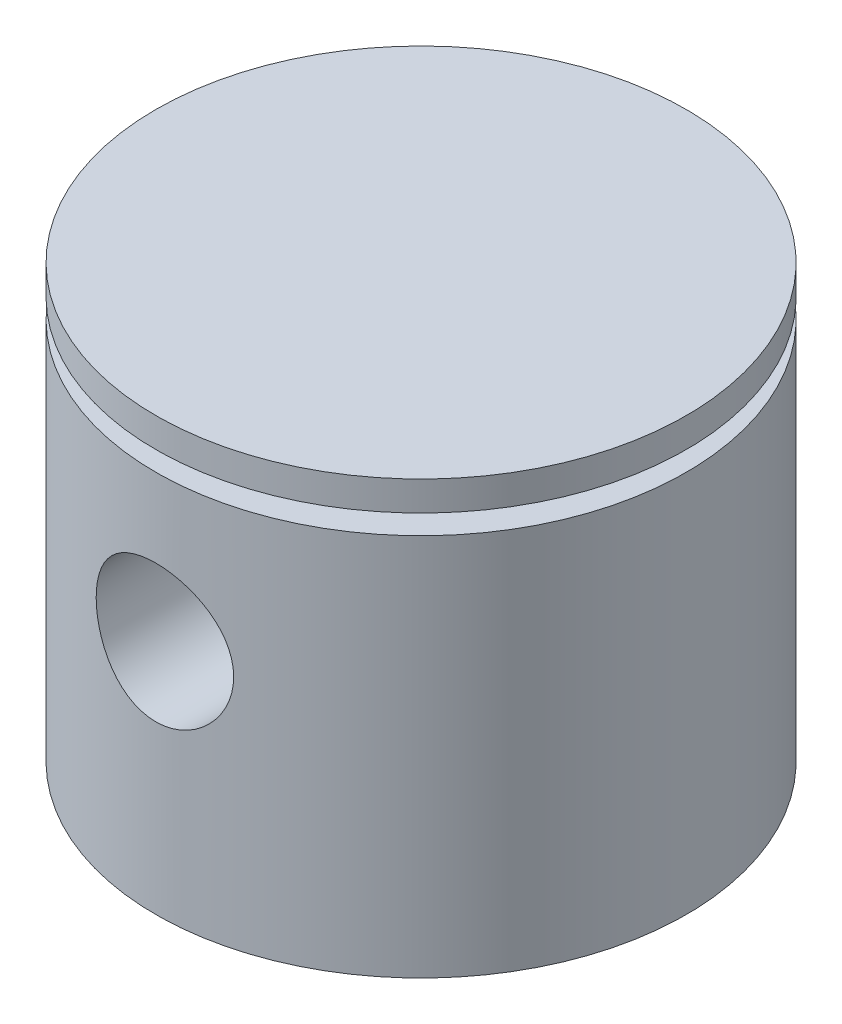
ISO-10303-21;
HEADER;
FILE_DESCRIPTION(('STEP AP214'),'2;1');
FILE_NAME('part.step','',(''),(''),'','','');
FILE_SCHEMA(('AUTOMOTIVE_DESIGN { 1 0 10303 214 1 1 1 1 }'));
ENDSEC;
DATA;
#1=APPLICATION_CONTEXT('core data for automotive mechanical design processes');
#2=APPLICATION_PROTOCOL_DEFINITION('international standard','automotive_design',2000,#1);
#3=PRODUCT_CONTEXT('',#1,'mechanical');
#4=PRODUCT('Part','Part','',(#3));
#5=PRODUCT_RELATED_PRODUCT_CATEGORY('part','',(#4));
#6=PRODUCT_DEFINITION_FORMATION('','',#4);
#7=PRODUCT_DEFINITION_CONTEXT('part definition',#1,'design');
#8=PRODUCT_DEFINITION('design','',#6,#7);
#9=PRODUCT_DEFINITION_SHAPE('','',#8);
#10=(LENGTH_UNIT() NAMED_UNIT(*) SI_UNIT(.MILLI.,.METRE.));
#11=(NAMED_UNIT(*) PLANE_ANGLE_UNIT() SI_UNIT($,.RADIAN.));
#12=(NAMED_UNIT(*) SI_UNIT($,.STERADIAN.) SOLID_ANGLE_UNIT());
#13=UNCERTAINTY_MEASURE_WITH_UNIT(LENGTH_MEASURE(1.E-05),#10,'distance_accuracy_value','');
#14=(GEOMETRIC_REPRESENTATION_CONTEXT(3) GLOBAL_UNCERTAINTY_ASSIGNED_CONTEXT((#13)) GLOBAL_UNIT_ASSIGNED_CONTEXT((#10,
#11,#12)) REPRESENTATION_CONTEXT('',''));
#15=CARTESIAN_POINT('',(0.,0.,0.));
#16=DIRECTION('',(0.,0.,1.));
#17=DIRECTION('',(1.,0.,0.));
#18=AXIS2_PLACEMENT_3D('',#15,#16,#17);
#19=CARTESIAN_POINT('',(-13.5,0.,0.));
#20=DIRECTION('',(0.,1.,0.));
#21=DIRECTION('',(-1.,0.,0.));
#22=AXIS2_PLACEMENT_3D('',#19,#20,#21);
#23=PLANE('',#22);
#24=CARTESIAN_POINT('',(0.,0.,0.));
#25=DIRECTION('',(0.,1.,0.));
#26=DIRECTION('',(-1.,0.,0.));
#27=AXIS2_PLACEMENT_3D('',#24,#25,#26);
#28=CIRCLE('',#27,13.5);
#29=CARTESIAN_POINT('',(-13.5,0.,0.));
#30=VERTEX_POINT('',#29);
#31=EDGE_CURVE('E129',#30,#30,#28,.T.);
#32=ORIENTED_EDGE('',*,*,#31,.T.);
#33=EDGE_LOOP('',(#32));
#34=FACE_BOUND('',#33,.T.);
#35=ADVANCED_FACE('F34',(#34),#23,.T.);
#36=CARTESIAN_POINT('',(0.,-3.,0.));
#37=DIRECTION('',(0.,-1.,0.));
#38=DIRECTION('',(1.,0.,0.));
#39=AXIS2_PLACEMENT_3D('',#36,#37,#38);
#40=PLANE('',#39);
#41=CARTESIAN_POINT('',(0.,-3.,0.));
#42=DIRECTION('',(0.,1.,0.));
#43=DIRECTION('',(-1.,0.,0.));
#44=AXIS2_PLACEMENT_3D('',#41,#42,#43);
#45=CIRCLE('',#44,7.);
#46=CARTESIAN_POINT('',(-7.,-3.,0.));
#47=VERTEX_POINT('',#46);
#48=EDGE_CURVE('E49',#47,#47,#45,.T.);
#49=ORIENTED_EDGE('',*,*,#48,.F.);
#50=EDGE_LOOP('',(#49));
#51=FACE_BOUND('',#50,.T.);
#52=ADVANCED_FACE('F92',(#51),#40,.T.);
#53=CARTESIAN_POINT('',(0.,0.,0.));
#54=DIRECTION('',(0.,1.,0.));
#55=DIRECTION('',(-1.,0.,0.));
#56=AXIS2_PLACEMENT_3D('',#53,#54,#55);
#57=CYLINDRICAL_SURFACE('',#56,7.);
#58=CARTESIAN_POINT('',(3.5,-10.,-6.06217782649107));
#59=CARTESIAN_POINT('',(3.49999956339732,-9.90876783970011,-6.06217838000061));
#60=CARTESIAN_POINT('',(3.49642792389145,-9.81752756193152,-6.06424447605956));
#61=CARTESIAN_POINT('',(3.48218913508999,-9.63575134944973,-6.07243150824313));
#62=CARTESIAN_POINT('',(3.47151868246889,-9.54521576250594,-6.07855433209937));
#63=CARTESIAN_POINT('',(3.44319969467244,-9.36544050175365,-6.09464039096269));
#64=CARTESIAN_POINT('',(3.42554021516251,-9.27620308911414,-6.10460964860236));
#65=CARTESIAN_POINT('',(3.38346810867625,-9.09978777983006,-6.12802725620062));
#66=CARTESIAN_POINT('',(3.35905254712794,-9.01261079605429,-6.1414771178296));
#67=CARTESIAN_POINT('',(3.27637383514563,-8.75602192255572,-6.18621982567766));
#68=CARTESIAN_POINT('',(3.20849068342823,-8.59038611188811,-6.22201962971363));
#69=CARTESIAN_POINT('',(3.04943048822246,-8.2729878953145,-6.30149515669602));
#70=CARTESIAN_POINT('',(2.95825218456469,-8.12122624054502,-6.34517130568186));
#71=CARTESIAN_POINT('',(2.74633222566438,-7.82193734720966,-6.43989014203716));
#72=CARTESIAN_POINT('',(2.62377249633983,-7.67579173048744,-6.49124329448661));
#73=CARTESIAN_POINT('',(2.35639796160147,-7.40507193587529,-6.59301832981094));
#74=CARTESIAN_POINT('',(2.21157212276478,-7.28050851795815,-6.64343973703042));
#75=CARTESIAN_POINT('',(1.89167303586647,-7.04820153552738,-6.74175654692166));
#76=CARTESIAN_POINT('',(1.71521894349515,-6.94215773518304,-6.7892525767614));
#77=CARTESIAN_POINT('',(1.43717634193612,-6.80700858315573,-6.85154168585872));
#78=CARTESIAN_POINT('',(1.34223033670876,-6.7659340128136,-6.87081779646072));
#79=CARTESIAN_POINT('',(1.14851918972932,-6.69218805949904,-6.9058351653357));
#80=CARTESIAN_POINT('',(1.0497562291509,-6.65951195662547,-6.92157840843028));
#81=CARTESIAN_POINT('',(0.856293047271141,-6.6049828946943,-6.94806564699471));
#82=CARTESIAN_POINT('',(0.761799423918771,-6.58252796537021,-6.95908444384902));
#83=CARTESIAN_POINT('',(0.570959543899398,-6.54551790662552,-6.97733380252561));
#84=CARTESIAN_POINT('',(0.474614217683191,-6.53095891180554,-6.98456621788415));
#85=CARTESIAN_POINT('',(0.28084967475871,-6.50992661060362,-6.99503586222835));
#86=CARTESIAN_POINT('',(0.183430773988689,-6.50345098628892,-6.99827423651509));
#87=CARTESIAN_POINT('',(-0.0116273304509108,-6.49865764739087,-7.00067156571555));
#88=CARTESIAN_POINT('',(-0.109266520276703,-6.50033943369514,-6.9998307702139));
#89=CARTESIAN_POINT('',(-0.38429510468394,-6.51662506134215,-6.99169222403876));
#90=CARTESIAN_POINT('',(-0.561092380246751,-6.54073623666047,-6.97964409624937));
#91=CARTESIAN_POINT('',(-0.907630020967151,-6.61507977109196,-6.94310184431136));
#92=CARTESIAN_POINT('',(-1.07736985703299,-6.66531408484058,-6.91860678883803));
#93=CARTESIAN_POINT('',(-1.4080742192286,-6.79079002209367,-6.85900450614999));
#94=CARTESIAN_POINT('',(-1.56888484366596,-6.86636801677066,-6.82375514375715));
#95=CARTESIAN_POINT('',(-1.8759209447004,-7.03992103570679,-6.7458179194099));
#96=CARTESIAN_POINT('',(-2.02214117261599,-7.1379040784298,-6.70312739566786));
#97=CARTESIAN_POINT('',(-2.31060792075682,-7.36413662334202,-6.60955344260832));
#98=CARTESIAN_POINT('',(-2.45117227638486,-7.49437161463084,-6.55827701738784));
#99=CARTESIAN_POINT('',(-2.70936227995222,-7.7760530133303,-6.45590306396165));
#100=CARTESIAN_POINT('',(-2.82697027930841,-7.92751558778296,-6.40480570282283));
#101=CARTESIAN_POINT('',(-3.04328139203151,-8.25931250598308,-6.30504098213601));
#102=CARTESIAN_POINT('',(-3.14030968987606,-8.44086950924457,-6.25673399939454));
#103=CARTESIAN_POINT('',(-3.26133310964906,-8.72549023026427,-6.19401060186596));
#104=CARTESIAN_POINT('',(-3.2975926372931,-8.82243236278298,-6.1747227090965));
#105=CARTESIAN_POINT('',(-3.36153180341711,-9.01977670447694,-6.14014885681131));
#106=CARTESIAN_POINT('',(-3.38921673273672,-9.12017673732865,-6.12486043038762));
#107=CARTESIAN_POINT('',(-3.43377916012519,-9.3156002235405,-6.09998031990017));
#108=CARTESIAN_POINT('',(-3.45133612498609,-9.41042432985663,-6.09003479308439));
#109=CARTESIAN_POINT('',(-3.47857887058632,-9.6015077784056,-6.074515266829));
#110=CARTESIAN_POINT('',(-3.48826874466199,-9.69776634768537,-6.06893899406988));
#111=CARTESIAN_POINT('',(-3.49963441115529,-9.89088284126757,-6.0623927334111));
#112=CARTESIAN_POINT('',(-3.50131318771324,-9.9877405289337,-6.06142103030645));
#113=CARTESIAN_POINT('',(-3.4966486629301,-10.1811675375594,-6.06411112066564));
#114=CARTESIAN_POINT('',(-3.49030590307485,-10.2777368775425,-6.06777260137102));
#115=CARTESIAN_POINT('',(-3.46161824436789,-10.5446689920494,-6.08421908511994));
#116=CARTESIAN_POINT('',(-3.43065523616977,-10.7138959453071,-6.10189020770591));
#117=CARTESIAN_POINT('',(-3.344939119225,-11.0443193959298,-6.14928610781903));
#118=CARTESIAN_POINT('',(-3.29017830614363,-11.205513273802,-6.1790147886689));
#119=CARTESIAN_POINT('',(-3.15576595224878,-11.5239304545732,-6.2487691031854));
#120=CARTESIAN_POINT('',(-3.07507905936516,-11.6806240825548,-6.28920787148186));
#121=CARTESIAN_POINT('',(-2.89200488769886,-11.9791449280937,-6.37546382424485));
#122=CARTESIAN_POINT('',(-2.78960646141121,-12.1209644526134,-6.42128376619316));
#123=CARTESIAN_POINT('',(-2.55093003311768,-12.4044248977372,-6.52008005997018));
#124=CARTESIAN_POINT('',(-2.41200843915967,-12.54378981605,-6.57323044098861));
#125=CARTESIAN_POINT('',(-2.11191574784142,-12.7979430445106,-6.67569819362743));
#126=CARTESIAN_POINT('',(-1.95073716497933,-12.9127230529548,-6.72501426692929));
#127=CARTESIAN_POINT('',(-1.60487376517276,-13.1170079821693,-6.81594766774415));
#128=CARTESIAN_POINT('',(-1.41968084087147,-13.2057658988636,-6.85732746098029));
#129=CARTESIAN_POINT('',(-1.03432827688114,-13.3499826783623,-6.92591742111843));
#130=CARTESIAN_POINT('',(-0.834181953644694,-13.4054707806489,-6.95314002739457));
#131=CARTESIAN_POINT('',(-0.444428889271708,-13.476789973824,-6.98836278752708));
#132=CARTESIAN_POINT('',(-0.255540058258719,-13.4957925748211,-6.99789747919145));
#133=CARTESIAN_POINT('',(0.122940955609667,-13.502951419839,-7.00147456072567));
#134=CARTESIAN_POINT('',(0.312532869036787,-13.4911184620464,-6.99552237388753));
#135=CARTESIAN_POINT('',(0.673882956292403,-13.4390426115115,-6.96968891722386));
#136=CARTESIAN_POINT('',(0.845993051456534,-13.4007231560588,-6.95075134182771));
#137=CARTESIAN_POINT('',(1.18106089353429,-13.2993553739606,-6.90172324976767));
#138=CARTESIAN_POINT('',(1.34401732410582,-13.2363035010262,-6.87163113372996));
#139=CARTESIAN_POINT('',(1.66398168539689,-13.0844558165377,-6.80140768663223));
#140=CARTESIAN_POINT('',(1.82043709959407,-12.9946742682378,-6.76090202225989));
#141=CARTESIAN_POINT('',(2.11671214661927,-12.793145341654,-6.67408423946858));
#142=CARTESIAN_POINT('',(2.25652409118355,-12.6813878745669,-6.62776945772402));
#143=CARTESIAN_POINT('',(2.53019531440925,-12.4262178238933,-6.52850308617827));
#144=CARTESIAN_POINT('',(2.66207744722746,-12.2807617929154,-6.47534971402989));
#145=CARTESIAN_POINT('',(2.90033596726623,-11.9688919500998,-6.37220091113588));
#146=CARTESIAN_POINT('',(3.00668978938671,-11.8024597936472,-6.32220830280382));
#147=CARTESIAN_POINT('',(3.14609819272059,-11.5370462420862,-6.25338904021468));
#148=CARTESIAN_POINT('',(3.18972977002774,-11.4443615682368,-6.23118088900335));
#149=CARTESIAN_POINT('',(3.26889800450942,-11.2549211671086,-6.19001580347162));
#150=CARTESIAN_POINT('',(3.30443883130347,-11.158167567375,-6.17105719572879));
#151=CARTESIAN_POINT('',(3.36691395764373,-10.9615144887952,-6.13719418126031));
#152=CARTESIAN_POINT('',(3.39387039794446,-10.8616238450393,-6.1222793598748));
#153=CARTESIAN_POINT('',(3.43889497857826,-10.6593354986716,-6.09710349334749));
#154=CARTESIAN_POINT('',(3.45696933329418,-10.5569396016766,-6.08683919484421));
#155=CARTESIAN_POINT('',(3.48027615598229,-10.3787014791471,-6.07353278780424));
#156=CARTESIAN_POINT('',(3.48766550855654,-10.3032230485278,-6.06928503621559));
#157=CARTESIAN_POINT('',(3.4975277766738,-10.151831638126,-6.06360723100921));
#158=CARTESIAN_POINT('',(3.50000036331791,-10.0759186296137,-6.0621773658894));
#159=CARTESIAN_POINT('',(3.5,-10.,-6.06217782649107));
#160=B_SPLINE_CURVE_WITH_KNOTS('',3,(#58,#59,#60,#61,#62,#63,#64,#65,#66,#67,#68,#69,#70,#71,
#72,#73,#74,#75,#76,#77,#78,#79,#80,#81,#82,#83,#84,#85,#86,#87,#88,#89,#90,#91,#92,#93,#94,#95,
#96,#97,#98,#99,#100,#101,#102,#103,#104,#105,#106,#107,#108,#109,#110,#111,#112,#113,#114,#115,
#116,#117,#118,#119,#120,#121,#122,#123,#124,#125,#126,#127,#128,#129,#130,#131,#132,#133,#134,
#135,#136,#137,#138,#139,#140,#141,#142,#143,#144,#145,#146,#147,#148,#149,#150,#151,#152,#153,
#154,#155,#156,#157,#158,#159),.UNSPECIFIED.,.T.,.F.,(4,2,2,2,2,2,2,2,2,2,2,2,2,2,2,2,2,2,2,2,2,
2,2,2,2,2,2,2,2,2,2,2,2,2,2,2,2,2,2,2,2,2,2,2,2,2,2,2,2,2,4),(0.,0.273617669189538,
0.547362751371639,0.821538206448543,1.09583293983044,1.64090790070131,2.18601235407281,
2.77607590875861,3.36643280296777,3.99658404337151,4.31189694333943,4.62703224947414,
4.91988214563307,5.21258854947495,5.50521099950819,5.7978155456191,6.33156812856655,
6.86536065471863,7.40653843219784,7.94791019386722,8.54045641759888,9.13345640521485,
9.7641141771384,10.0795717502392,10.3948342849403,10.6852664033651,10.9755473096532,
11.2657200776223,11.5558732588124,12.0721264170602,12.5885468324815,13.1288853714324,
13.669502014921,14.2782660225408,14.8872352714564,15.5122763466731,16.1367672905263,
16.7039594608513,17.2709530350083,17.8005848677215,18.3302926701398,18.8826562724008,
19.4352740507445,20.0428884619717,20.6510379967997,20.9651345817897,21.2790689268034,
21.592186891934,21.9050854699481,22.1327605463739,22.3604508522341),.UNSPECIFIED.);
#161=CARTESIAN_POINT('',(3.5,-10.,-6.06217782649107));
#162=VERTEX_POINT('',#161);
#163=EDGE_CURVE('E82',#162,#162,#160,.T.);
#164=ORIENTED_EDGE('',*,*,#163,.F.);
#165=EDGE_LOOP('',(#164));
#166=FACE_BOUND('',#165,.T.);
#167=CARTESIAN_POINT('',(3.5,-10.,6.06217782649107));
#168=CARTESIAN_POINT('',(3.49999956339732,-10.0912321602999,6.06217838000061));
#169=CARTESIAN_POINT('',(3.49642792389145,-10.1824724380685,6.06424447605956));
#170=CARTESIAN_POINT('',(3.48218913508999,-10.3642486505503,6.07243150824313));
#171=CARTESIAN_POINT('',(3.47151868246889,-10.4547842374941,6.07855433209937));
#172=CARTESIAN_POINT('',(3.44319969467244,-10.6345594982463,6.09464039096269));
#173=CARTESIAN_POINT('',(3.42554021516251,-10.7237969108859,6.10460964860236));
#174=CARTESIAN_POINT('',(3.38346810867625,-10.9002122201699,6.12802725620062));
#175=CARTESIAN_POINT('',(3.35905254712794,-10.9873892039457,6.1414771178296));
#176=CARTESIAN_POINT('',(3.27637383514563,-11.2439780774443,6.18621982567766));
#177=CARTESIAN_POINT('',(3.20849068342822,-11.4096138881119,6.22201962971363));
#178=CARTESIAN_POINT('',(3.04943048822246,-11.7270121046855,6.30149515669602));
#179=CARTESIAN_POINT('',(2.95825218456469,-11.878773759455,6.34517130568186));
#180=CARTESIAN_POINT('',(2.74633222566438,-12.1780626527903,6.43989014203716));
#181=CARTESIAN_POINT('',(2.62377249633983,-12.3242082695126,6.49124329448661));
#182=CARTESIAN_POINT('',(2.35639796160147,-12.5949280641247,6.59301832981095));
#183=CARTESIAN_POINT('',(2.21157212276478,-12.7194914820418,6.64343973703042));
#184=CARTESIAN_POINT('',(1.89167303586647,-12.9517984644726,6.74175654692166));
#185=CARTESIAN_POINT('',(1.71521894349515,-13.057842264817,6.7892525767614));
#186=CARTESIAN_POINT('',(1.43717634193612,-13.1929914168443,6.85154168585872));
#187=CARTESIAN_POINT('',(1.34223033670875,-13.2340659871864,6.87081779646073));
#188=CARTESIAN_POINT('',(1.14851918972932,-13.307811940501,6.9058351653357));
#189=CARTESIAN_POINT('',(1.0497562291509,-13.3404880433745,6.92157840843028));
#190=CARTESIAN_POINT('',(0.856293047271139,-13.3950171053057,6.94806564699471));
#191=CARTESIAN_POINT('',(0.761799423918769,-13.4174720346298,6.95908444384902));
#192=CARTESIAN_POINT('',(0.570959543899396,-13.4544820933745,6.97733380252561));
#193=CARTESIAN_POINT('',(0.47461421768319,-13.4690410881945,6.98456621788415));
#194=CARTESIAN_POINT('',(0.280849674758709,-13.4900733893964,6.99503586222835));
#195=CARTESIAN_POINT('',(0.183430773988688,-13.4965490137111,6.99827423651509));
#196=CARTESIAN_POINT('',(-0.0116273304509114,-13.5013423526091,7.00067156571555));
#197=CARTESIAN_POINT('',(-0.109266520276704,-13.4996605663049,6.9998307702139));
#198=CARTESIAN_POINT('',(-0.384295104683939,-13.4833749386578,6.99169222403876));
#199=CARTESIAN_POINT('',(-0.56109238024675,-13.4592637633395,6.97964409624937));
#200=CARTESIAN_POINT('',(-0.90763002096715,-13.384920228908,6.94310184431136));
#201=CARTESIAN_POINT('',(-1.07736985703299,-13.3346859151594,6.91860678883803));
#202=CARTESIAN_POINT('',(-1.4080742192286,-13.2092099779063,6.85900450614999));
#203=CARTESIAN_POINT('',(-1.56888484366596,-13.1336319832293,6.82375514375715));
#204=CARTESIAN_POINT('',(-1.8759209447004,-12.9600789642932,6.7458179194099));
#205=CARTESIAN_POINT('',(-2.02214117261599,-12.8620959215702,6.70312739566786));
#206=CARTESIAN_POINT('',(-2.31060792075682,-12.635863376658,6.60955344260832));
#207=CARTESIAN_POINT('',(-2.45117227638486,-12.5056283853692,6.55827701738784));
#208=CARTESIAN_POINT('',(-2.70936227995222,-12.2239469866697,6.45590306396165));
#209=CARTESIAN_POINT('',(-2.82697027930841,-12.072484412217,6.40480570282283));
#210=CARTESIAN_POINT('',(-3.04328139203151,-11.7406874940169,6.30504098213601));
#211=CARTESIAN_POINT('',(-3.14030968987606,-11.5591304907554,6.25673399939454));
#212=CARTESIAN_POINT('',(-3.26133310964906,-11.2745097697357,6.19401060186596));
#213=CARTESIAN_POINT('',(-3.2975926372931,-11.177567637217,6.1747227090965));
#214=CARTESIAN_POINT('',(-3.36153180341711,-10.9802232955231,6.14014885681131));
#215=CARTESIAN_POINT('',(-3.38921673273672,-10.8798232626713,6.12486043038763));
#216=CARTESIAN_POINT('',(-3.43377916012519,-10.6843997764595,6.09998031990017));
#217=CARTESIAN_POINT('',(-3.45133612498609,-10.5895756701434,6.09003479308439));
#218=CARTESIAN_POINT('',(-3.47857887058632,-10.3984922215944,6.074515266829));
#219=CARTESIAN_POINT('',(-3.48826874466199,-10.3022336523146,6.06893899406988));
#220=CARTESIAN_POINT('',(-3.49963441115529,-10.1091171587324,6.0623927334111));
#221=CARTESIAN_POINT('',(-3.50131318771324,-10.0122594710663,6.06142103030645));
#222=CARTESIAN_POINT('',(-3.4966486629301,-9.81883246244062,6.06411112066564));
#223=CARTESIAN_POINT('',(-3.49030590307485,-9.72226312245751,6.06777260137102));
#224=CARTESIAN_POINT('',(-3.46161824436789,-9.45533100795056,6.08421908511994));
#225=CARTESIAN_POINT('',(-3.43065523616977,-9.28610405469295,6.10189020770591));
#226=CARTESIAN_POINT('',(-3.344939119225,-8.95568060407022,6.14928610781903));
#227=CARTESIAN_POINT('',(-3.29017830614363,-8.79448672619804,6.1790147886689));
#228=CARTESIAN_POINT('',(-3.15576595224878,-8.47606954542678,6.2487691031854));
#229=CARTESIAN_POINT('',(-3.07507905936516,-8.31937591744522,6.28920787148186));
#230=CARTESIAN_POINT('',(-2.89200488769887,-8.02085507190628,6.37546382424484));
#231=CARTESIAN_POINT('',(-2.78960646141122,-7.87903554738662,6.42128376619316));
#232=CARTESIAN_POINT('',(-2.55093003311768,-7.59557510226283,6.52008005997018));
#233=CARTESIAN_POINT('',(-2.41200843915967,-7.45621018394998,6.57323044098861));
#234=CARTESIAN_POINT('',(-2.11191574784142,-7.20205695548936,6.67569819362743));
#235=CARTESIAN_POINT('',(-1.95073716497933,-7.08727694704525,6.72501426692929));
#236=CARTESIAN_POINT('',(-1.60487376517276,-6.88299201783074,6.81594766774415));
#237=CARTESIAN_POINT('',(-1.41968084087147,-6.79423410113638,6.85732746098029));
#238=CARTESIAN_POINT('',(-1.03432827688114,-6.65001732163765,6.92591742111843));
#239=CARTESIAN_POINT('',(-0.834181953644695,-6.5945292193511,6.95314002739457));
#240=CARTESIAN_POINT('',(-0.44442888927171,-6.52321002617599,6.98836278752708));
#241=CARTESIAN_POINT('',(-0.255540058258722,-6.50420742517892,6.99789747919145));
#242=CARTESIAN_POINT('',(0.122940955609665,-6.49704858016104,7.00147456072567));
#243=CARTESIAN_POINT('',(0.312532869036786,-6.50888153795358,6.99552237388753));
#244=CARTESIAN_POINT('',(0.673882956292402,-6.56095738848853,6.96968891722386));
#245=CARTESIAN_POINT('',(0.845993051456532,-6.59927684394123,6.95075134182771));
#246=CARTESIAN_POINT('',(1.18106089353429,-6.70064462603944,6.90172324976767));
#247=CARTESIAN_POINT('',(1.34401732410582,-6.76369649897383,6.87163113372997));
#248=CARTESIAN_POINT('',(1.66398168539689,-6.91554418346227,6.80140768663223));
#249=CARTESIAN_POINT('',(1.82043709959407,-7.00532573176216,6.76090202225989));
#250=CARTESIAN_POINT('',(2.11671214661927,-7.20685465834602,6.67408423946858));
#251=CARTESIAN_POINT('',(2.25652409118355,-7.31861212543305,6.62776945772402));
#252=CARTESIAN_POINT('',(2.53019531440925,-7.5737821761067,6.52850308617827));
#253=CARTESIAN_POINT('',(2.66207744722746,-7.71923820708463,6.47534971402989));
#254=CARTESIAN_POINT('',(2.90033596726623,-8.03110804990017,6.37220091113588));
#255=CARTESIAN_POINT('',(3.00668978938671,-8.19754020635281,6.32220830280382));
#256=CARTESIAN_POINT('',(3.14609819272059,-8.46295375791379,6.25338904021468));
#257=CARTESIAN_POINT('',(3.18972977002774,-8.55563843176317,6.23118088900335));
#258=CARTESIAN_POINT('',(3.26889800450942,-8.74507883289145,6.19001580347162));
#259=CARTESIAN_POINT('',(3.30443883130347,-8.84183243262497,6.17105719572879));
#260=CARTESIAN_POINT('',(3.36691395764373,-9.0384855112048,6.13719418126031));
#261=CARTESIAN_POINT('',(3.39387039794446,-9.13837615496072,6.1222793598748));
#262=CARTESIAN_POINT('',(3.43889497857826,-9.34066450132839,6.09710349334749));
#263=CARTESIAN_POINT('',(3.45696933329418,-9.44306039832342,6.08683919484421));
#264=CARTESIAN_POINT('',(3.48027615598229,-9.62129852085289,6.07353278780424));
#265=CARTESIAN_POINT('',(3.48766550855654,-9.69677695147221,6.06928503621559));
#266=CARTESIAN_POINT('',(3.4975277766738,-9.84816836187403,6.06360723100921));
#267=CARTESIAN_POINT('',(3.50000036331791,-9.92408137038628,6.0621773658894));
#268=CARTESIAN_POINT('',(3.5,-10.,6.06217782649107));
#269=B_SPLINE_CURVE_WITH_KNOTS('',3,(#167,#168,#169,#170,#171,#172,#173,#174,#175,#176,#177,
#178,#179,#180,#181,#182,#183,#184,#185,#186,#187,#188,#189,#190,#191,#192,#193,#194,#195,#196,
#197,#198,#199,#200,#201,#202,#203,#204,#205,#206,#207,#208,#209,#210,#211,#212,#213,#214,#215,
#216,#217,#218,#219,#220,#221,#222,#223,#224,#225,#226,#227,#228,#229,#230,#231,#232,#233,#234,
#235,#236,#237,#238,#239,#240,#241,#242,#243,#244,#245,#246,#247,#248,#249,#250,#251,#252,#253,
#254,#255,#256,#257,#258,#259,#260,#261,#262,#263,#264,#265,#266,#267,#268),.UNSPECIFIED.,.T.,
.F.,(4,2,2,2,2,2,2,2,2,2,2,2,2,2,2,2,2,2,2,2,2,2,2,2,2,2,2,2,2,2,2,2,2,2,2,2,2,2,2,2,2,2,2,2,2,
2,2,2,2,2,4),(0.,0.273617669189538,0.547362751371639,0.821538206448543,1.09583293983044,
1.64090790070131,2.18601235407281,2.77607590875861,3.36643280296777,3.99658404337151,
4.31189694333943,4.62703224947414,4.91988214563307,5.21258854947495,5.5052109995082,
5.7978155456191,6.33156812856654,6.86536065471863,7.40653843219784,7.94791019386722,
8.54045641759888,9.13345640521485,9.7641141771384,10.0795717502392,10.3948342849403,
10.6852664033651,10.9755473096532,11.2657200776223,11.5558732588124,12.0721264170602,
12.5885468324815,13.1288853714324,13.669502014921,14.2782660225408,14.8872352714564,
15.5122763466731,16.1367672905263,16.7039594608513,17.2709530350083,17.8005848677215,
18.3302926701398,18.8826562724008,19.4352740507445,20.0428884619717,20.6510379967997,
20.9651345817897,21.2790689268034,21.592186891934,21.9050854699481,22.1327605463739,
22.3604508522341),.UNSPECIFIED.);
#270=CARTESIAN_POINT('',(3.5,-10.,6.06217782649107));
#271=VERTEX_POINT('',#270);
#272=EDGE_CURVE('E76',#271,#271,#269,.T.);
#273=ORIENTED_EDGE('',*,*,#272,.F.);
#274=EDGE_LOOP('',(#273));
#275=FACE_BOUND('',#274,.T.);
#276=ORIENTED_EDGE('',*,*,#48,.T.);
#277=EDGE_LOOP('',(#276));
#278=FACE_BOUND('',#277,.T.);
#279=CARTESIAN_POINT('',(0.,-16.,0.));
#280=DIRECTION('',(0.,1.,0.));
#281=DIRECTION('',(-1.,0.,0.));
#282=AXIS2_PLACEMENT_3D('',#279,#280,#281);
#283=CIRCLE('',#282,7.);
#284=CARTESIAN_POINT('',(-7.,-16.,0.));
#285=VERTEX_POINT('',#284);
#286=EDGE_CURVE('E53',#285,#285,#283,.T.);
#287=ORIENTED_EDGE('',*,*,#286,.F.);
#288=EDGE_LOOP('',(#287));
#289=FACE_BOUND('',#288,.T.);
#290=ADVANCED_FACE('F87',(#166,#275,#278,#289),#57,.F.);
#291=CARTESIAN_POINT('',(-7.,-16.,0.));
#292=DIRECTION('',(0.,-1.,0.));
#293=DIRECTION('',(1.,0.,0.));
#294=AXIS2_PLACEMENT_3D('',#291,#292,#293);
#295=PLANE('',#294);
#296=ORIENTED_EDGE('',*,*,#286,.T.);
#297=EDGE_LOOP('',(#296));
#298=FACE_BOUND('',#297,.T.);
#299=CARTESIAN_POINT('',(0.,-16.,0.));
#300=DIRECTION('',(0.,1.,0.));
#301=DIRECTION('',(-1.,0.,0.));
#302=AXIS2_PLACEMENT_3D('',#299,#300,#301);
#303=CIRCLE('',#302,12.);
#304=CARTESIAN_POINT('',(-12.,-16.,0.));
#305=VERTEX_POINT('',#304);
#306=EDGE_CURVE('E108',#305,#305,#303,.T.);
#307=ORIENTED_EDGE('',*,*,#306,.F.);
#308=EDGE_LOOP('',(#307));
#309=FACE_BOUND('',#308,.T.);
#310=ADVANCED_FACE('F91',(#298,#309),#295,.T.);
#311=CARTESIAN_POINT('',(0.,0.,0.));
#312=DIRECTION('',(0.,1.,0.));
#313=DIRECTION('',(-1.,0.,0.));
#314=AXIS2_PLACEMENT_3D('',#311,#312,#313);
#315=CYLINDRICAL_SURFACE('',#314,12.);
#316=ORIENTED_EDGE('',*,*,#306,.T.);
#317=EDGE_LOOP('',(#316));
#318=FACE_BOUND('',#317,.T.);
#319=CARTESIAN_POINT('',(0.,-22.,0.));
#320=DIRECTION('',(0.,1.,0.));
#321=DIRECTION('',(-1.,0.,0.));
#322=AXIS2_PLACEMENT_3D('',#319,#320,#321);
#323=CIRCLE('',#322,12.);
#324=CARTESIAN_POINT('',(-12.,-22.,0.));
#325=VERTEX_POINT('',#324);
#326=EDGE_CURVE('E110',#325,#325,#323,.T.);
#327=ORIENTED_EDGE('',*,*,#326,.F.);
#328=EDGE_LOOP('',(#327));
#329=FACE_BOUND('',#328,.T.);
#330=ADVANCED_FACE('F186',(#318,#329),#315,.F.);
#331=CARTESIAN_POINT('',(-12.,-22.,0.));
#332=DIRECTION('',(0.,-1.,0.));
#333=DIRECTION('',(1.,0.,0.));
#334=AXIS2_PLACEMENT_3D('',#331,#332,#333);
#335=PLANE('',#334);
#336=ORIENTED_EDGE('',*,*,#326,.T.);
#337=EDGE_LOOP('',(#336));
#338=FACE_BOUND('',#337,.T.);
#339=CARTESIAN_POINT('',(0.,-22.,0.));
#340=DIRECTION('',(0.,1.,0.));
#341=DIRECTION('',(-1.,0.,0.));
#342=AXIS2_PLACEMENT_3D('',#339,#340,#341);
#343=CIRCLE('',#342,13.5);
#344=CARTESIAN_POINT('',(-13.5,-22.,0.));
#345=VERTEX_POINT('',#344);
#346=EDGE_CURVE('E115',#345,#345,#343,.T.);
#347=ORIENTED_EDGE('',*,*,#346,.F.);
#348=EDGE_LOOP('',(#347));
#349=FACE_BOUND('',#348,.T.);
#350=ADVANCED_FACE('F180',(#338,#349),#335,.T.);
#351=CARTESIAN_POINT('',(0.,0.,0.));
#352=DIRECTION('',(0.,1.,0.));
#353=DIRECTION('',(-1.,0.,0.));
#354=AXIS2_PLACEMENT_3D('',#351,#352,#353);
#355=CYLINDRICAL_SURFACE('',#354,13.5);
#356=CARTESIAN_POINT('',(0.,-6.5,-13.5));
#357=CARTESIAN_POINT('',(0.193140618240471,-6.50000497623003,-13.4999969118576));
#358=CARTESIAN_POINT('',(0.386335548600798,-6.51604081275947,-13.495814170209));
#359=CARTESIAN_POINT('',(0.767172830073048,-6.57965484455771,-13.4795341776931));
#360=CARTESIAN_POINT('',(0.954812241983919,-6.62724943543445,-13.4674328129346));
#361=CARTESIAN_POINT('',(1.31898516387817,-6.75233929239007,-13.4366532216563));
#362=CARTESIAN_POINT('',(1.49553223227796,-6.82979719510649,-13.4179832160074));
#363=CARTESIAN_POINT('',(1.83312840695162,-7.01227958757246,-13.3760463121345));
#364=CARTESIAN_POINT('',(1.9941767075059,-7.11730550941738,-13.3527791751155));
#365=CARTESIAN_POINT('',(2.29975008536733,-7.35438489573935,-13.303593478471));
#366=CARTESIAN_POINT('',(2.44388524492371,-7.48693195221371,-13.2776315710013));
#367=CARTESIAN_POINT('',(2.70814962316904,-7.77423520419556,-13.2262650620559));
#368=CARTESIAN_POINT('',(2.8282759273548,-7.92899409214735,-13.2008605285742));
#369=CARTESIAN_POINT('',(3.04298331037743,-8.25940197698554,-13.1530446726781));
#370=CARTESIAN_POINT('',(3.13712142606622,-8.43534748536271,-13.1306881969627));
#371=CARTESIAN_POINT('',(3.29432911152367,-8.80124085716215,-13.0921347637907));
#372=CARTESIAN_POINT('',(3.35740406315247,-8.99118628846178,-13.0759367394603));
#373=CARTESIAN_POINT('',(3.44935160693338,-9.37538307546551,-13.0519808457498));
#374=CARTESIAN_POINT('',(3.4789285193535,-9.56945479309506,-13.0440494614227));
#375=CARTESIAN_POINT('',(3.50523535158572,-9.95995512124099,-13.0370060198733));
#376=CARTESIAN_POINT('',(3.50197104725124,-10.1563833112503,-13.0378924118498));
#377=CARTESIAN_POINT('',(3.46324852342107,-10.5405685448675,-13.0482287650372));
#378=CARTESIAN_POINT('',(3.42863664579192,-10.7284179051792,-13.0574535871974));
#379=CARTESIAN_POINT('',(3.32955455249235,-11.0955480289107,-13.0830676738746));
#380=CARTESIAN_POINT('',(3.26508206729865,-11.2748281398913,-13.0994574829533));
#381=CARTESIAN_POINT('',(3.10740504245194,-11.6219653161681,-13.1377566990292));
#382=CARTESIAN_POINT('',(3.0138990895262,-11.7896788688561,-13.1597235465776));
#383=CARTESIAN_POINT('',(2.80101992540441,-12.1073349693456,-13.2066701554281));
#384=CARTESIAN_POINT('',(2.681641876011,-12.2572741851428,-13.231650479876));
#385=CARTESIAN_POINT('',(2.41605424697535,-12.5399675521929,-13.28275142812));
#386=CARTESIAN_POINT('',(2.26913235624932,-12.6720513219462,-13.3088834932049));
#387=CARTESIAN_POINT('',(1.95490696772602,-12.9098383033989,-13.358652797065));
#388=CARTESIAN_POINT('',(1.7876027516608,-13.0155405850211,-13.3822899478651));
#389=CARTESIAN_POINT('',(1.43636065775993,-13.1978369544965,-13.424538661486));
#390=CARTESIAN_POINT('',(1.25236016504338,-13.2743153495452,-13.4431301669767));
#391=CARTESIAN_POINT('',(0.873523113344337,-13.3950639540042,-13.4730475021387));
#392=CARTESIAN_POINT('',(0.678688797378528,-13.4393408038388,-13.4843748297316));
#393=CARTESIAN_POINT('',(0.289440611157424,-13.4933898961058,-13.4982631892375));
#394=CARTESIAN_POINT('',(0.0951614671530464,-13.5040742379557,-13.5010558918275));
#395=CARTESIAN_POINT('',(-0.292410889379297,-13.49314611493,-13.4982235923972));
#396=CARTESIAN_POINT('',(-0.485704195996526,-13.471536792345,-13.4925994093703));
#397=CARTESIAN_POINT('',(-0.862601390832054,-13.3973846195816,-13.4737143969592));
#398=CARTESIAN_POINT('',(-1.04631118311946,-13.3453454734944,-13.4605779934553));
#399=CARTESIAN_POINT('',(-1.4023795900627,-13.2123914455675,-13.428154098426));
#400=CARTESIAN_POINT('',(-1.57473700839017,-13.1314735261928,-13.4088659598699));
#401=CARTESIAN_POINT('',(-1.90679057696056,-12.941332944448,-13.365729768678));
#402=CARTESIAN_POINT('',(-2.06618831003628,-12.8316074557723,-13.34180291361));
#403=CARTESIAN_POINT('',(-2.36463043277793,-12.5876033053305,-13.2921574619827));
#404=CARTESIAN_POINT('',(-2.50367102246377,-12.4533200699704,-13.2664385322237));
#405=CARTESIAN_POINT('',(-2.76125748880094,-12.1597649566543,-13.2152634787224));
#406=CARTESIAN_POINT('',(-2.87916143139891,-11.9999244217702,-13.1898324495145));
#407=CARTESIAN_POINT('',(-3.08648035109913,-11.6621949268546,-13.1428680982705));
#408=CARTESIAN_POINT('',(-3.17589656032281,-11.4843067478396,-13.1213346076796));
#409=CARTESIAN_POINT('',(-3.32302956220913,-11.1164548277247,-13.0848470867192));
#410=CARTESIAN_POINT('',(-3.38093269547015,-10.926569648546,-13.0698544862503));
#411=CARTESIAN_POINT('',(-3.46386140485676,-10.5393067902196,-13.0481238755455));
#412=CARTESIAN_POINT('',(-3.4888948275355,-10.3419309108078,-13.0413838952964));
#413=CARTESIAN_POINT('',(-3.50494058655124,-9.95184322611046,-13.0370797649328));
#414=CARTESIAN_POINT('',(-3.49698200850121,-9.7591761607671,-13.0392380487562));
#415=CARTESIAN_POINT('',(-3.44964239462833,-9.37803220628321,-13.0518410665737));
#416=CARTESIAN_POINT('',(-3.41026208513713,-9.18955522039006,-13.062285609026));
#417=CARTESIAN_POINT('',(-3.30177814824579,-8.8233570900416,-13.090123774054));
#418=CARTESIAN_POINT('',(-3.23288127609558,-8.64557076040572,-13.1074690000536));
#419=CARTESIAN_POINT('',(-3.06748160331797,-8.30394934428448,-13.1471577847997));
#420=CARTESIAN_POINT('',(-2.9709746939479,-8.14011633895274,-13.1695020873676));
#421=CARTESIAN_POINT('',(-2.74992716601834,-7.82611249608417,-13.2174509317284));
#422=CARTESIAN_POINT('',(-2.62467893237101,-7.67645096309818,-13.2431290941895));
#423=CARTESIAN_POINT('',(-2.35106487858852,-7.3999351678843,-13.2944286968102));
#424=CARTESIAN_POINT('',(-2.20269350852271,-7.27308639687708,-13.3200501218507));
#425=CARTESIAN_POINT('',(-1.88348441707643,-7.0433262827603,-13.3689580790859));
#426=CARTESIAN_POINT('',(-1.71225863682153,-6.94094106418493,-13.3921880542304));
#427=CARTESIAN_POINT('',(-1.35443300202786,-6.766571156225,-13.4330873880808));
#428=CARTESIAN_POINT('',(-1.1678436399359,-6.69456592151504,-13.4507605027037));
#429=CARTESIAN_POINT('',(-0.818150001735751,-6.59298092245784,-13.4761206304321));
#430=CARTESIAN_POINT('',(-0.65662687383067,-6.558191487183,-13.4850118475553));
#431=CARTESIAN_POINT('',(-0.330082181464949,-6.51169991041239,-13.4969525961578));
#432=CARTESIAN_POINT('',(-0.165060924630275,-6.49999574723775,-13.5000026391737));
#433=CARTESIAN_POINT('',(0.,-6.5,-13.5));
#434=B_SPLINE_CURVE_WITH_KNOTS('',3,(#356,#357,#358,#359,#360,#361,#362,#363,#364,#365,#366,
#367,#368,#369,#370,#371,#372,#373,#374,#375,#376,#377,#378,#379,#380,#381,#382,#383,#384,#385,
#386,#387,#388,#389,#390,#391,#392,#393,#394,#395,#396,#397,#398,#399,#400,#401,#402,#403,#404,
#405,#406,#407,#408,#409,#410,#411,#412,#413,#414,#415,#416,#417,#418,#419,#420,#421,#422,#423,
#424,#425,#426,#427,#428,#429,#430,#431,#432,#433),.UNSPECIFIED.,.T.,.F.,(4,2,2,2,2,2,2,2,2,2,2,
2,2,2,2,2,2,2,2,2,2,2,2,2,2,2,2,2,2,2,2,2,2,2,2,2,2,2,4),(0.,0.57881673103703,1.15793440853858,
1.73632986436162,2.31475537245067,2.9046241204756,3.4945644309102,4.0940137522667,
4.69335917923681,5.27985434396532,5.86624636236673,6.43726366689068,7.008324378093,
7.58552387267583,8.16283139941728,8.75789471497631,9.35297900648407,9.95039532118385,
10.5476884050378,11.1286172510858,11.7094895743333,12.2810085135565,12.852587584167,
13.4348964314833,14.0173138376752,14.6151900252453,15.2130403505929,15.8073160063315,
16.4014497726614,16.977193039237,17.5529229975568,18.1246844240645,18.6965309806137,
19.2843471197154,19.8723045621998,20.4719529521116,21.071195160247,21.5659041119515,
22.0605697378919),.UNSPECIFIED.);
#435=CARTESIAN_POINT('',(0.,-6.5,-13.5));
#436=VERTEX_POINT('',#435);
#437=EDGE_CURVE('E10',#436,#436,#434,.T.);
#438=ORIENTED_EDGE('',*,*,#437,.F.);
#439=EDGE_LOOP('',(#438));
#440=FACE_BOUND('',#439,.T.);
#441=CARTESIAN_POINT('',(3.5,-10.,13.0384048104053));
#442=CARTESIAN_POINT('',(3.49999495634461,-9.80698241065803,13.0384083294697));
#443=CARTESIAN_POINT('',(3.4839788391036,-9.61391037358348,13.0427377262377));
#444=CARTESIAN_POINT('',(3.42045021983798,-9.23332798205078,13.0595391731166));
#445=CARTESIAN_POINT('',(3.37292078025866,-9.04582067513642,13.0720156019813));
#446=CARTESIAN_POINT('',(3.24802129755812,-8.68192800399049,13.1036052329617));
#447=CARTESIAN_POINT('',(3.17069165432549,-8.50552795679042,13.1227094463626));
#448=CARTESIAN_POINT('',(2.98851188538961,-8.16818105199565,13.1653907466464));
#449=CARTESIAN_POINT('',(2.88366005560157,-8.00723515211485,13.1889681104673));
#450=CARTESIAN_POINT('',(2.64676172522389,-7.70155855079318,13.2385637427003));
#451=CARTESIAN_POINT('',(2.5141824230835,-7.5572473955771,13.2646233766476));
#452=CARTESIAN_POINT('',(2.22673925589506,-7.29263982558614,13.3158894407199));
#453=CARTESIAN_POINT('',(2.07187318767842,-7.17234578784461,13.3410957861879));
#454=CARTESIAN_POINT('',(1.74135917228324,-6.95745256960653,13.3882750232915));
#455=CARTESIAN_POINT('',(1.56543303452983,-6.86326825481535,13.4101934180519));
#456=CARTESIAN_POINT('',(1.19958103818171,-6.70596995647903,13.4478537410988));
#457=CARTESIAN_POINT('',(1.00965741186466,-6.64285103099277,13.4635966517121));
#458=CARTESIAN_POINT('',(0.625578481229562,-6.5508267332004,13.4868397439725));
#459=CARTESIAN_POINT('',(0.431604604564198,-6.52120822733741,13.4945114809006));
#460=CARTESIAN_POINT('',(0.0412996455895364,-6.49478421437457,13.5013467491731));
#461=CARTESIAN_POINT('',(-0.155031058061147,-6.49797350487376,13.5005116294677));
#462=CARTESIAN_POINT('',(-0.539520879411532,-6.53656751915269,13.4905538853163));
#463=CARTESIAN_POINT('',(-0.72776321220428,-6.57120209314391,13.4816293922668));
#464=CARTESIAN_POINT('',(-1.09566706027364,-6.67046216184873,13.4567280566943));
#465=CARTESIAN_POINT('',(-1.27532809969341,-6.73508931761074,13.4407508235791));
#466=CARTESIAN_POINT('',(-1.62296389792622,-6.89310505927279,13.4032411826864));
#467=CARTESIAN_POINT('',(-1.7908108365338,-6.98676211433702,13.3816572389612));
#468=CARTESIAN_POINT('',(-2.10867174973746,-7.19997412381711,13.335266902482));
#469=CARTESIAN_POINT('',(-2.25868240715688,-7.31953388396444,13.310459912098));
#470=CARTESIAN_POINT('',(-2.54120788524909,-7.58526409004256,13.2594680484051));
#471=CARTESIAN_POINT('',(-2.67308761181471,-7.7321068639083,13.2332640828747));
#472=CARTESIAN_POINT('',(-2.91049883119756,-8.04609702146251,13.183086203406));
#473=CARTESIAN_POINT('',(-3.0160288937825,-8.21324550659213,13.1591124105633));
#474=CARTESIAN_POINT('',(-3.19819357975702,-8.56441991698299,13.1160363003604));
#475=CARTESIAN_POINT('',(-3.27466454277901,-8.74853438347542,13.0969617649921));
#476=CARTESIAN_POINT('',(-3.39536473475019,-9.12762253230746,13.0661938057046));
#477=CARTESIAN_POINT('',(-3.43960145913776,-9.32259367878195,13.0544986659369));
#478=CARTESIAN_POINT('',(-3.49350125627487,-9.71194355703004,13.0401767873716));
#479=CARTESIAN_POINT('',(-3.5041079315507,-9.90618270924478,13.0373026228726));
#480=CARTESIAN_POINT('',(-3.49303890452566,-10.293657616663,13.0402727274976));
#481=CARTESIAN_POINT('',(-3.47136642587723,-10.4868934701299,13.0461161260165));
#482=CARTESIAN_POINT('',(-3.39718416011597,-10.8633007216767,13.0656248063354));
#483=CARTESIAN_POINT('',(-3.34523350177657,-11.0465903783964,13.0791481541272));
#484=CARTESIAN_POINT('',(-3.21259427389849,-11.4018570618267,13.1123560963521));
#485=CARTESIAN_POINT('',(-3.13190210615558,-11.5738326689149,13.1320414621825));
#486=CARTESIAN_POINT('',(-2.942128017942,-11.90556006463,13.1758691473331));
#487=CARTESIAN_POINT('',(-2.83248744686697,-12.0649808263979,13.2000960983879));
#488=CARTESIAN_POINT('',(-2.58862757604369,-12.3635078450036,13.2500742584186));
#489=CARTESIAN_POINT('',(-2.45440391873345,-12.5026104924119,13.2758257370814));
#490=CARTESIAN_POINT('',(-2.16083873449639,-12.7604268480308,13.3267972316632));
#491=CARTESIAN_POINT('',(-2.00091447345321,-12.8784848945109,13.3519838663202));
#492=CARTESIAN_POINT('',(-1.66296703706099,-13.0860747940048,13.3982679509889));
#493=CARTESIAN_POINT('',(-1.4849448206532,-13.175608157394,13.4193656174874));
#494=CARTESIAN_POINT('',(-1.11710197606313,-13.3228035578605,13.4549595815643));
#495=CARTESIAN_POINT('',(-0.927380156489424,-13.3807002406949,13.4695043358761));
#496=CARTESIAN_POINT('',(-0.540469500017507,-13.4636709790454,13.4905664616686));
#497=CARTESIAN_POINT('',(-0.343282229577383,-13.4887518813749,13.4970855076479));
#498=CARTESIAN_POINT('',(0.0468212498925992,-13.5049698322556,13.5012874583823));
#499=CARTESIAN_POINT('',(0.239695248024978,-13.4970712338952,13.4992214084098));
#500=CARTESIAN_POINT('',(0.621269482193451,-13.4497798321265,13.4870480583833));
#501=CARTESIAN_POINT('',(0.809969859657255,-13.4103880975829,13.476941031237));
#502=CARTESIAN_POINT('',(1.17674815766236,-13.3017615428616,13.4498662878243));
#503=CARTESIAN_POINT('',(1.35488456224374,-13.2327128190616,13.4329413938583));
#504=CARTESIAN_POINT('',(1.69714517332855,-13.066899430644,13.3940061498029));
#505=CARTESIAN_POINT('',(1.86126749720312,-12.9701310497925,13.3719951179174));
#506=CARTESIAN_POINT('',(2.17536864378413,-12.7487492597294,13.3245512129664));
#507=CARTESIAN_POINT('',(2.3248810085109,-12.6234896644365,13.299045489835));
#508=CARTESIAN_POINT('',(2.6010908439861,-12.3499197609839,13.2477961552912));
#509=CARTESIAN_POINT('',(2.72778240468885,-12.2016035001703,13.2220524840655));
#510=CARTESIAN_POINT('',(2.95731164734156,-11.8824779609631,13.1726385105523));
#511=CARTESIAN_POINT('',(3.05960815824039,-11.7112705136211,13.1490214152677));
#512=CARTESIAN_POINT('',(3.23381685201667,-11.3534972925782,13.1072692892144));
#513=CARTESIAN_POINT('',(3.30574992987769,-11.1669421865484,13.0891304909392));
#514=CARTESIAN_POINT('',(3.40718547491869,-10.8174229815439,13.0630512204949));
#515=CARTESIAN_POINT('',(3.44191188937191,-10.6560474337467,13.05388119816));
#516=CARTESIAN_POINT('',(3.48832015100721,-10.3297942714128,13.0415567914048));
#517=CARTESIAN_POINT('',(3.50000430937185,-10.1649170097818,13.038401803666));
#518=CARTESIAN_POINT('',(3.5,-10.,13.0384048104053));
#519=B_SPLINE_CURVE_WITH_KNOTS('',3,(#441,#442,#443,#444,#445,#446,#447,#448,#449,#450,#451,
#452,#453,#454,#455,#456,#457,#458,#459,#460,#461,#462,#463,#464,#465,#466,#467,#468,#469,#470,
#471,#472,#473,#474,#475,#476,#477,#478,#479,#480,#481,#482,#483,#484,#485,#486,#487,#488,#489,
#490,#491,#492,#493,#494,#495,#496,#497,#498,#499,#500,#501,#502,#503,#504,#505,#506,#507,#508,
#509,#510,#511,#512,#513,#514,#515,#516,#517,#518),.UNSPECIFIED.,.T.,.F.,(4,2,2,2,2,2,2,2,2,2,2,
2,2,2,2,2,2,2,2,2,2,2,2,2,2,2,2,2,2,2,2,2,2,2,2,2,2,2,4),(0.,0.578446709519974,1.15720457073204,
1.73518055938045,2.31319234287757,2.90354440195003,3.49395486068864,4.09326934588482,
4.69248846015349,5.278696494279,5.86481157360237,6.43694785238457,7.00911582098544,
7.58674158489849,8.16447460769084,8.75899618961598,9.35355003454101,9.95140444606387,
10.549119793897,11.1299086714718,11.71063955075,12.2809717307679,12.8513753368666,
13.4337129634054,14.0161539143418,14.6143990969806,15.2126125974063,15.8063268163877,
16.3999171407361,16.9762737160372,17.5526107308491,18.1253829113385,18.6982319164533,
19.2856651084798,19.8732502136964,20.4728590530808,21.0720545886174,21.5663373728768,
22.0605705771011),.UNSPECIFIED.);
#520=CARTESIAN_POINT('',(3.5,-10.,13.0384048104053));
#521=VERTEX_POINT('',#520);
#522=EDGE_CURVE('E45',#521,#521,#519,.T.);
#523=ORIENTED_EDGE('',*,*,#522,.F.);
#524=EDGE_LOOP('',(#523));
#525=FACE_BOUND('',#524,.T.);
#526=ORIENTED_EDGE('',*,*,#346,.T.);
#527=EDGE_LOOP('',(#526));
#528=FACE_BOUND('',#527,.T.);
#529=CARTESIAN_POINT('',(0.,-2.5,0.));
#530=DIRECTION('',(0.,1.,0.));
#531=DIRECTION('',(-1.,0.,0.));
#532=AXIS2_PLACEMENT_3D('',#529,#530,#531);
#533=CIRCLE('',#532,13.5);
#534=CARTESIAN_POINT('',(-13.5,-2.5,0.));
#535=VERTEX_POINT('',#534);
#536=EDGE_CURVE('E118',#535,#535,#533,.T.);
#537=ORIENTED_EDGE('',*,*,#536,.F.);
#538=EDGE_LOOP('',(#537));
#539=FACE_BOUND('',#538,.T.);
#540=ADVANCED_FACE('F59',(#440,#525,#528,#539),#355,.T.);
#541=CARTESIAN_POINT('',(-13.5,-2.5,0.));
#542=DIRECTION('',(0.,1.,0.));
#543=DIRECTION('',(-1.,0.,0.));
#544=AXIS2_PLACEMENT_3D('',#541,#542,#543);
#545=PLANE('',#544);
#546=ORIENTED_EDGE('',*,*,#536,.T.);
#547=EDGE_LOOP('',(#546));
#548=FACE_BOUND('',#547,.T.);
#549=CARTESIAN_POINT('',(0.,-2.5,0.));
#550=DIRECTION('',(0.,1.,0.));
#551=DIRECTION('',(-1.,0.,0.));
#552=AXIS2_PLACEMENT_3D('',#549,#550,#551);
#553=CIRCLE('',#552,11.5);
#554=CARTESIAN_POINT('',(-11.5,-2.5,0.));
#555=VERTEX_POINT('',#554);
#556=EDGE_CURVE('E121',#555,#555,#553,.T.);
#557=ORIENTED_EDGE('',*,*,#556,.F.);
#558=EDGE_LOOP('',(#557));
#559=FACE_BOUND('',#558,.T.);
#560=ADVANCED_FACE('F166',(#548,#559),#545,.T.);
#561=CARTESIAN_POINT('',(0.,0.,0.));
#562=DIRECTION('',(0.,1.,0.));
#563=DIRECTION('',(-1.,0.,0.));
#564=AXIS2_PLACEMENT_3D('',#561,#562,#563);
#565=CYLINDRICAL_SURFACE('',#564,11.5);
#566=ORIENTED_EDGE('',*,*,#556,.T.);
#567=EDGE_LOOP('',(#566));
#568=FACE_BOUND('',#567,.T.);
#569=CARTESIAN_POINT('',(0.,-1.5,0.));
#570=DIRECTION('',(0.,1.,0.));
#571=DIRECTION('',(-1.,0.,0.));
#572=AXIS2_PLACEMENT_3D('',#569,#570,#571);
#573=CIRCLE('',#572,11.5);
#574=CARTESIAN_POINT('',(-11.5,-1.5,0.));
#575=VERTEX_POINT('',#574);
#576=EDGE_CURVE('E124',#575,#575,#573,.T.);
#577=ORIENTED_EDGE('',*,*,#576,.F.);
#578=EDGE_LOOP('',(#577));
#579=FACE_BOUND('',#578,.T.);
#580=ADVANCED_FACE('F159',(#568,#579),#565,.T.);
#581=CARTESIAN_POINT('',(-11.5,-1.5,0.));
#582=DIRECTION('',(0.,-1.,0.));
#583=DIRECTION('',(1.,0.,0.));
#584=AXIS2_PLACEMENT_3D('',#581,#582,#583);
#585=PLANE('',#584);
#586=ORIENTED_EDGE('',*,*,#576,.T.);
#587=EDGE_LOOP('',(#586));
#588=FACE_BOUND('',#587,.T.);
#589=CARTESIAN_POINT('',(0.,-1.5,0.));
#590=DIRECTION('',(0.,1.,0.));
#591=DIRECTION('',(-1.,0.,0.));
#592=AXIS2_PLACEMENT_3D('',#589,#590,#591);
#593=CIRCLE('',#592,13.5);
#594=CARTESIAN_POINT('',(-13.5,-1.5,0.));
#595=VERTEX_POINT('',#594);
#596=EDGE_CURVE('E127',#595,#595,#593,.T.);
#597=ORIENTED_EDGE('',*,*,#596,.F.);
#598=EDGE_LOOP('',(#597));
#599=FACE_BOUND('',#598,.T.);
#600=ADVANCED_FACE('F151',(#588,#599),#585,.T.);
#601=CARTESIAN_POINT('',(0.,0.,0.));
#602=DIRECTION('',(0.,1.,0.));
#603=DIRECTION('',(-1.,0.,0.));
#604=AXIS2_PLACEMENT_3D('',#601,#602,#603);
#605=CYLINDRICAL_SURFACE('',#604,13.5);
#606=ORIENTED_EDGE('',*,*,#596,.T.);
#607=EDGE_LOOP('',(#606));
#608=FACE_BOUND('',#607,.T.);
#609=ORIENTED_EDGE('',*,*,#31,.F.);
#610=EDGE_LOOP('',(#609));
#611=FACE_BOUND('',#610,.T.);
#612=ADVANCED_FACE('F68',(#608,#611),#605,.T.);
#613=CARTESIAN_POINT('',(0.,-10.,-13.5));
#614=DIRECTION('',(0.,0.,1.));
#615=DIRECTION('',(1.,0.,0.));
#616=AXIS2_PLACEMENT_3D('',#613,#614,#615);
#617=CYLINDRICAL_SURFACE('',#616,3.5);
#618=ORIENTED_EDGE('',*,*,#272,.T.);
#619=EDGE_LOOP('',(#618));
#620=FACE_BOUND('',#619,.T.);
#621=ORIENTED_EDGE('',*,*,#522,.T.);
#622=EDGE_LOOP('',(#621));
#623=FACE_BOUND('',#622,.T.);
#624=ADVANCED_FACE('F63',(#620,#623),#617,.F.);
#625=ORIENTED_EDGE('',*,*,#163,.T.);
#626=EDGE_LOOP('',(#625));
#627=FACE_BOUND('',#626,.T.);
#628=ORIENTED_EDGE('',*,*,#437,.T.);
#629=EDGE_LOOP('',(#628));
#630=FACE_BOUND('',#629,.T.);
#631=ADVANCED_FACE('F67',(#627,#630),#617,.F.);
#632=CLOSED_SHELL('',(#35,#52,#290,#310,#330,#350,#540,#560,#580,#600,#612,#624,#631));
#633=MANIFOLD_SOLID_BREP('B2',#632);
#634=ADVANCED_BREP_SHAPE_REPRESENTATION('',(#18,#633),#14);
#635=SHAPE_DEFINITION_REPRESENTATION(#9,#634);
ENDSEC;
END-ISO-10303-21;
